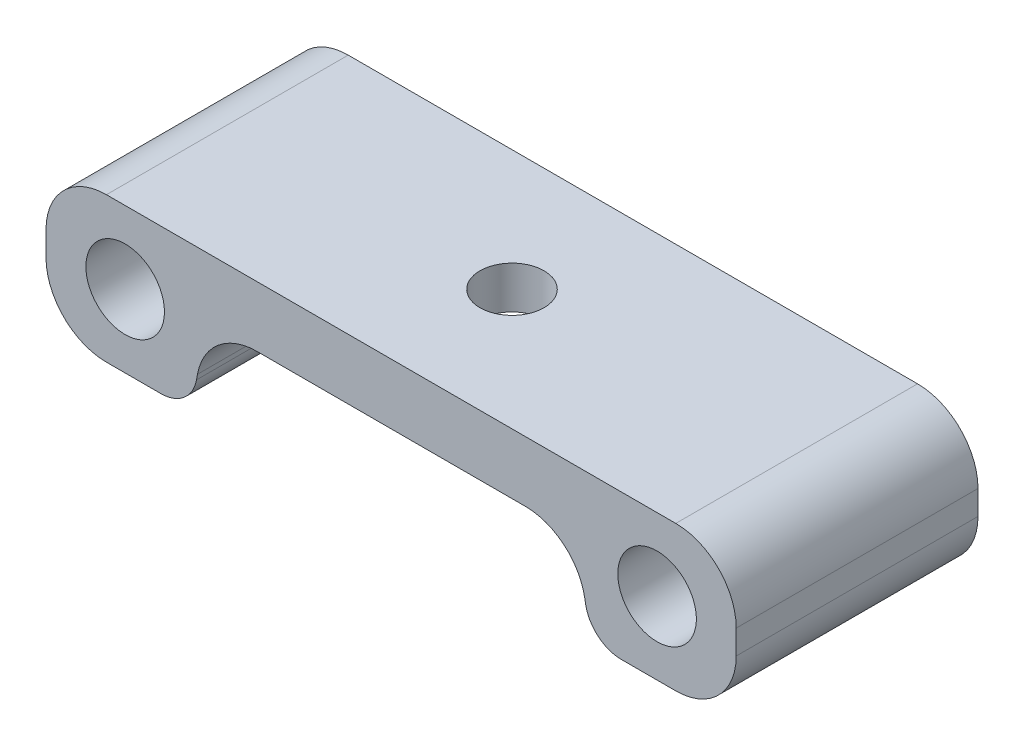
ISO-10303-21;
HEADER;
FILE_DESCRIPTION(('STEP AP214'),'2;1');
FILE_NAME('part.step','',(''),(''),'','','');
FILE_SCHEMA(('AUTOMOTIVE_DESIGN { 1 0 10303 214 1 1 1 1 }'));
ENDSEC;
DATA;
#1=APPLICATION_CONTEXT('core data for automotive mechanical design processes');
#2=APPLICATION_PROTOCOL_DEFINITION('international standard','automotive_design',2000,#1);
#3=PRODUCT_CONTEXT('',#1,'mechanical');
#4=PRODUCT('Part','Part','',(#3));
#5=PRODUCT_RELATED_PRODUCT_CATEGORY('part','',(#4));
#6=PRODUCT_DEFINITION_FORMATION('','',#4);
#7=PRODUCT_DEFINITION_CONTEXT('part definition',#1,'design');
#8=PRODUCT_DEFINITION('design','',#6,#7);
#9=PRODUCT_DEFINITION_SHAPE('','',#8);
#10=(LENGTH_UNIT() NAMED_UNIT(*) SI_UNIT(.MILLI.,.METRE.));
#11=(NAMED_UNIT(*) PLANE_ANGLE_UNIT() SI_UNIT($,.RADIAN.));
#12=(NAMED_UNIT(*) SI_UNIT($,.STERADIAN.) SOLID_ANGLE_UNIT());
#13=UNCERTAINTY_MEASURE_WITH_UNIT(LENGTH_MEASURE(1.E-05),#10,'distance_accuracy_value','');
#14=(GEOMETRIC_REPRESENTATION_CONTEXT(3) GLOBAL_UNCERTAINTY_ASSIGNED_CONTEXT((#13)) GLOBAL_UNIT_ASSIGNED_CONTEXT((#10,
#11,#12)) REPRESENTATION_CONTEXT('',''));
#15=CARTESIAN_POINT('',(0.,0.,0.));
#16=DIRECTION('',(0.,0.,1.));
#17=DIRECTION('',(1.,0.,0.));
#18=AXIS2_PLACEMENT_3D('',#15,#16,#17);
#19=CARTESIAN_POINT('',(0.,0.,10.));
#20=DIRECTION('',(0.,0.,-1.));
#21=DIRECTION('',(-1.,0.,0.));
#22=AXIS2_PLACEMENT_3D('',#19,#20,#21);
#23=PLANE('',#22);
#24=DIRECTION('',(-0.180192038345711,0.983631449942923,0.));
#25=VECTOR('',#24,1.);
#26=CARTESIAN_POINT('',(15.2657353642998,0.,10.));
#27=LINE('',#26,#25);
#28=CARTESIAN_POINT('',(16.0975262403234,-4.54057611503715,10.));
#29=VERTEX_POINT('',#28);
#30=CARTESIAN_POINT('',(16.0166409380851,-4.09903980827144,10.));
#31=VERTEX_POINT('',#30);
#32=EDGE_CURVE('E217',#29,#31,#27,.T.);
#33=ORIENTED_EDGE('',*,*,#32,.F.);
#34=CARTESIAN_POINT('',(19.0484205901522,-4.00000000000002,10.));
#35=DIRECTION('',(0.,0.,-1.));
#36=DIRECTION('',(-1.,0.,0.));
#37=AXIS2_PLACEMENT_3D('',#34,#35,#36);
#38=CIRCLE('',#37,3.);
#39=CARTESIAN_POINT('',(19.0484205901522,-7.00000000000002,10.));
#40=VERTEX_POINT('',#39);
#41=EDGE_CURVE('E316',#29,#40,#38,.F.);
#42=ORIENTED_EDGE('',*,*,#41,.T.);
#43=DIRECTION('',(-1.,0.,0.));
#44=VECTOR('',#43,1.);
#45=CARTESIAN_POINT('',(16.5480695845946,-7.00000000000001,10.));
#46=LINE('',#45,#44);
#47=CARTESIAN_POINT('',(23.5480695845946,-7.00000000000002,10.));
#48=VERTEX_POINT('',#47);
#49=EDGE_CURVE('E372',#48,#40,#46,.T.);
#50=ORIENTED_EDGE('',*,*,#49,.F.);
#51=CARTESIAN_POINT('',(23.5480695845946,-2.00000000000002,10.));
#52=DIRECTION('',(0.,0.,-1.));
#53=DIRECTION('',(-1.,0.,0.));
#54=AXIS2_PLACEMENT_3D('',#51,#52,#53);
#55=CIRCLE('',#54,5.);
#56=CARTESIAN_POINT('',(28.5480695845946,-2.00000000000003,10.));
#57=VERTEX_POINT('',#56);
#58=EDGE_CURVE('E269',#48,#57,#55,.F.);
#59=ORIENTED_EDGE('',*,*,#58,.T.);
#60=DIRECTION('',(0.,-1.,0.));
#61=VECTOR('',#60,1.);
#62=CARTESIAN_POINT('',(28.5480695845946,-7.00000000000003,10.));
#63=LINE('',#62,#61);
#64=CARTESIAN_POINT('',(28.5480695845946,0.,10.));
#65=VERTEX_POINT('',#64);
#66=EDGE_CURVE('E359',#65,#57,#63,.T.);
#67=ORIENTED_EDGE('',*,*,#66,.F.);
#68=CARTESIAN_POINT('',(23.5480695845946,0.,10.));
#69=DIRECTION('',(0.,0.,-1.));
#70=DIRECTION('',(-1.,0.,0.));
#71=AXIS2_PLACEMENT_3D('',#68,#69,#70);
#72=CIRCLE('',#71,5.);
#73=CARTESIAN_POINT('',(23.5480695845946,5.,10.));
#74=VERTEX_POINT('',#73);
#75=EDGE_CURVE('E266',#65,#74,#72,.F.);
#76=ORIENTED_EDGE('',*,*,#75,.T.);
#77=DIRECTION('',(-1.,0.,0.));
#78=VECTOR('',#77,1.);
#79=CARTESIAN_POINT('',(-28.5480695845946,5.,10.));
#80=LINE('',#79,#78);
#81=CARTESIAN_POINT('',(-23.5480695845946,5.,10.));
#82=VERTEX_POINT('',#81);
#83=EDGE_CURVE('E333',#74,#82,#80,.T.);
#84=ORIENTED_EDGE('',*,*,#83,.T.);
#85=CARTESIAN_POINT('',(-23.5480695845946,0.,10.));
#86=DIRECTION('',(0.,0.,-1.));
#87=DIRECTION('',(-1.,0.,0.));
#88=AXIS2_PLACEMENT_3D('',#85,#86,#87);
#89=CIRCLE('',#88,5.);
#90=CARTESIAN_POINT('',(-28.5480695845946,0.,10.));
#91=VERTEX_POINT('',#90);
#92=EDGE_CURVE('E260',#82,#91,#89,.F.);
#93=ORIENTED_EDGE('',*,*,#92,.T.);
#94=DIRECTION('',(0.,-1.,0.));
#95=VECTOR('',#94,1.);
#96=CARTESIAN_POINT('',(-28.5480695845946,-7.,10.));
#97=LINE('',#96,#95);
#98=CARTESIAN_POINT('',(-28.5480695845946,-2.,10.));
#99=VERTEX_POINT('',#98);
#100=EDGE_CURVE('E350',#91,#99,#97,.T.);
#101=ORIENTED_EDGE('',*,*,#100,.T.);
#102=CARTESIAN_POINT('',(-23.5480695845946,-2.,10.));
#103=DIRECTION('',(0.,0.,-1.));
#104=DIRECTION('',(-1.,0.,0.));
#105=AXIS2_PLACEMENT_3D('',#102,#103,#104);
#106=CIRCLE('',#105,5.);
#107=CARTESIAN_POINT('',(-23.5480695845946,-7.,10.));
#108=VERTEX_POINT('',#107);
#109=EDGE_CURVE('E263',#99,#108,#106,.F.);
#110=ORIENTED_EDGE('',*,*,#109,.T.);
#111=DIRECTION('',(1.,0.,0.));
#112=VECTOR('',#111,1.);
#113=CARTESIAN_POINT('',(-16.5480695845946,-7.,10.));
#114=LINE('',#113,#112);
#115=CARTESIAN_POINT('',(-19.0484205901522,-7.,10.));
#116=VERTEX_POINT('',#115);
#117=EDGE_CURVE('E348',#108,#116,#114,.T.);
#118=ORIENTED_EDGE('',*,*,#117,.T.);
#119=CARTESIAN_POINT('',(-19.0484205901522,-4.,10.));
#120=DIRECTION('',(0.,0.,-1.));
#121=DIRECTION('',(-1.,0.,0.));
#122=AXIS2_PLACEMENT_3D('',#119,#120,#121);
#123=CIRCLE('',#122,3.);
#124=CARTESIAN_POINT('',(-16.0975262403234,-4.54057611503714,10.));
#125=VERTEX_POINT('',#124);
#126=EDGE_CURVE('E62',#116,#125,#123,.F.);
#127=ORIENTED_EDGE('',*,*,#126,.T.);
#128=DIRECTION('',(0.180192038345712,0.983631449942923,0.));
#129=VECTOR('',#128,1.);
#130=CARTESIAN_POINT('',(-15.2657353642998,0.,10.));
#131=LINE('',#130,#129);
#132=CARTESIAN_POINT('',(-16.0166409380851,-4.09903980827144,10.));
#133=VERTEX_POINT('',#132);
#134=EDGE_CURVE('E230',#125,#133,#131,.T.);
#135=ORIENTED_EDGE('',*,*,#134,.T.);
#136=CARTESIAN_POINT('',(-11.0984836883705,-5.,10.));
#137=DIRECTION('',(0.,0.,-1.));
#138=DIRECTION('',(-1.,0.,0.));
#139=AXIS2_PLACEMENT_3D('',#136,#137,#138);
#140=CIRCLE('',#139,5.);
#141=CARTESIAN_POINT('',(-11.0984836883705,0.,10.));
#142=VERTEX_POINT('',#141);
#143=EDGE_CURVE('E299',#133,#142,#140,.T.);
#144=ORIENTED_EDGE('',*,*,#143,.T.);
#145=DIRECTION('',(1.,0.,0.));
#146=VECTOR('',#145,1.);
#147=CARTESIAN_POINT('',(0.,0.,10.));
#148=LINE('',#147,#146);
#149=CARTESIAN_POINT('',(11.0984836883705,0.,10.));
#150=VERTEX_POINT('',#149);
#151=EDGE_CURVE('E221',#142,#150,#148,.T.);
#152=ORIENTED_EDGE('',*,*,#151,.T.);
#153=CARTESIAN_POINT('',(11.0984836883705,-5.,10.));
#154=DIRECTION('',(0.,0.,-1.));
#155=DIRECTION('',(-1.,0.,0.));
#156=AXIS2_PLACEMENT_3D('',#153,#154,#155);
#157=CIRCLE('',#156,5.);
#158=EDGE_CURVE('E212',#150,#31,#157,.T.);
#159=ORIENTED_EDGE('',*,*,#158,.T.);
#160=EDGE_LOOP('',(#33,#42,#50,#59,#67,#76,#84,#93,#101,#110,#118,#127,#135,#144,#152,#159));
#161=FACE_BOUND('',#160,.T.);
#162=CARTESIAN_POINT('',(-22.,-0.999999999999998,10.));
#163=DIRECTION('',(0.,0.,1.));
#164=DIRECTION('',(1.,0.,0.));
#165=AXIS2_PLACEMENT_3D('',#162,#163,#164);
#166=CIRCLE('',#165,3.25);
#167=CARTESIAN_POINT('',(-18.75,-0.999999999999998,10.));
#168=VERTEX_POINT('',#167);
#169=EDGE_CURVE('E344',#168,#168,#166,.T.);
#170=ORIENTED_EDGE('',*,*,#169,.F.);
#171=EDGE_LOOP('',(#170));
#172=FACE_BOUND('',#171,.T.);
#173=CARTESIAN_POINT('',(22.,-1.00000000000002,10.));
#174=DIRECTION('',(0.,0.,-1.));
#175=DIRECTION('',(-1.,0.,0.));
#176=AXIS2_PLACEMENT_3D('',#173,#174,#175);
#177=CIRCLE('',#176,3.25);
#178=CARTESIAN_POINT('',(18.75,-1.00000000000002,10.));
#179=VERTEX_POINT('',#178);
#180=EDGE_CURVE('E202',#179,#179,#177,.T.);
#181=ORIENTED_EDGE('',*,*,#180,.T.);
#182=EDGE_LOOP('',(#181));
#183=FACE_BOUND('',#182,.T.);
#184=ADVANCED_FACE('F42',(#161,#172,#183),#23,.F.);
#185=CARTESIAN_POINT('',(0.,0.,-10.));
#186=DIRECTION('',(0.,0.,-1.));
#187=DIRECTION('',(-1.,0.,0.));
#188=AXIS2_PLACEMENT_3D('',#185,#186,#187);
#189=PLANE('',#188);
#190=DIRECTION('',(-1.,0.,0.));
#191=VECTOR('',#190,1.);
#192=CARTESIAN_POINT('',(16.5480695845946,-7.00000000000001,-10.));
#193=LINE('',#192,#191);
#194=CARTESIAN_POINT('',(23.5480695845946,-7.00000000000002,-10.));
#195=VERTEX_POINT('',#194);
#196=CARTESIAN_POINT('',(19.0484205901522,-7.00000000000002,-10.));
#197=VERTEX_POINT('',#196);
#198=EDGE_CURVE('E201',#195,#197,#193,.T.);
#199=ORIENTED_EDGE('',*,*,#198,.T.);
#200=CARTESIAN_POINT('',(19.0484205901522,-4.00000000000002,-10.));
#201=DIRECTION('',(0.,0.,-1.));
#202=DIRECTION('',(-1.,0.,0.));
#203=AXIS2_PLACEMENT_3D('',#200,#201,#202);
#204=CIRCLE('',#203,3.);
#205=CARTESIAN_POINT('',(16.0975262403234,-4.54057611503715,-10.));
#206=VERTEX_POINT('',#205);
#207=EDGE_CURVE('E196',#197,#206,#204,.T.);
#208=ORIENTED_EDGE('',*,*,#207,.T.);
#209=DIRECTION('',(-0.180192038345711,0.983631449942923,0.));
#210=VECTOR('',#209,1.);
#211=CARTESIAN_POINT('',(15.2657353642998,0.,-10.));
#212=LINE('',#211,#210);
#213=CARTESIAN_POINT('',(16.0166409380851,-4.09903980827144,-10.));
#214=VERTEX_POINT('',#213);
#215=EDGE_CURVE('E188',#206,#214,#212,.T.);
#216=ORIENTED_EDGE('',*,*,#215,.T.);
#217=CARTESIAN_POINT('',(11.0984836883705,-5.,-10.));
#218=DIRECTION('',(0.,0.,-1.));
#219=DIRECTION('',(-1.,0.,0.));
#220=AXIS2_PLACEMENT_3D('',#217,#218,#219);
#221=CIRCLE('',#220,5.);
#222=CARTESIAN_POINT('',(11.0984836883705,0.,-10.));
#223=VERTEX_POINT('',#222);
#224=EDGE_CURVE('E194',#214,#223,#221,.F.);
#225=ORIENTED_EDGE('',*,*,#224,.T.);
#226=DIRECTION('',(1.,0.,0.));
#227=VECTOR('',#226,1.);
#228=CARTESIAN_POINT('',(0.,0.,-10.));
#229=LINE('',#228,#227);
#230=CARTESIAN_POINT('',(-11.0984836883705,0.,-10.));
#231=VERTEX_POINT('',#230);
#232=EDGE_CURVE('E233',#231,#223,#229,.T.);
#233=ORIENTED_EDGE('',*,*,#232,.F.);
#234=CARTESIAN_POINT('',(-11.0984836883705,-5.,-10.));
#235=DIRECTION('',(0.,0.,-1.));
#236=DIRECTION('',(-1.,0.,0.));
#237=AXIS2_PLACEMENT_3D('',#234,#235,#236);
#238=CIRCLE('',#237,5.);
#239=CARTESIAN_POINT('',(-16.0166409380851,-4.09903980827144,-10.));
#240=VERTEX_POINT('',#239);
#241=EDGE_CURVE('E295',#231,#240,#238,.F.);
#242=ORIENTED_EDGE('',*,*,#241,.T.);
#243=DIRECTION('',(0.180192038345712,0.983631449942923,0.));
#244=VECTOR('',#243,1.);
#245=CARTESIAN_POINT('',(-15.2657353642998,0.,-10.));
#246=LINE('',#245,#244);
#247=CARTESIAN_POINT('',(-16.0975262403234,-4.54057611503714,-10.));
#248=VERTEX_POINT('',#247);
#249=EDGE_CURVE('E325',#248,#240,#246,.T.);
#250=ORIENTED_EDGE('',*,*,#249,.F.);
#251=CARTESIAN_POINT('',(-19.0484205901522,-4.,-10.));
#252=DIRECTION('',(0.,0.,-1.));
#253=DIRECTION('',(-1.,0.,0.));
#254=AXIS2_PLACEMENT_3D('',#251,#252,#253);
#255=CIRCLE('',#254,3.);
#256=CARTESIAN_POINT('',(-19.0484205901522,-7.,-10.));
#257=VERTEX_POINT('',#256);
#258=EDGE_CURVE('E306',#248,#257,#255,.T.);
#259=ORIENTED_EDGE('',*,*,#258,.T.);
#260=DIRECTION('',(1.,0.,0.));
#261=VECTOR('',#260,1.);
#262=CARTESIAN_POINT('',(-16.5480695845946,-7.,-10.));
#263=LINE('',#262,#261);
#264=CARTESIAN_POINT('',(-23.5480695845946,-7.,-10.));
#265=VERTEX_POINT('',#264);
#266=EDGE_CURVE('E330',#265,#257,#263,.T.);
#267=ORIENTED_EDGE('',*,*,#266,.F.);
#268=CARTESIAN_POINT('',(-23.5480695845946,-2.,-10.));
#269=DIRECTION('',(0.,0.,-1.));
#270=DIRECTION('',(-1.,0.,0.));
#271=AXIS2_PLACEMENT_3D('',#268,#269,#270);
#272=CIRCLE('',#271,5.);
#273=CARTESIAN_POINT('',(-28.5480695845946,-2.,-10.));
#274=VERTEX_POINT('',#273);
#275=EDGE_CURVE('E248',#265,#274,#272,.T.);
#276=ORIENTED_EDGE('',*,*,#275,.T.);
#277=DIRECTION('',(0.,-1.,0.));
#278=VECTOR('',#277,1.);
#279=CARTESIAN_POINT('',(-28.5480695845946,-7.,-10.));
#280=LINE('',#279,#278);
#281=CARTESIAN_POINT('',(-28.5480695845946,0.,-10.));
#282=VERTEX_POINT('',#281);
#283=EDGE_CURVE('E335',#282,#274,#280,.T.);
#284=ORIENTED_EDGE('',*,*,#283,.F.);
#285=CARTESIAN_POINT('',(-23.5480695845946,0.,-10.));
#286=DIRECTION('',(0.,0.,-1.));
#287=DIRECTION('',(-1.,0.,0.));
#288=AXIS2_PLACEMENT_3D('',#285,#286,#287);
#289=CIRCLE('',#288,5.);
#290=CARTESIAN_POINT('',(-23.5480695845946,5.,-10.));
#291=VERTEX_POINT('',#290);
#292=EDGE_CURVE('E245',#282,#291,#289,.T.);
#293=ORIENTED_EDGE('',*,*,#292,.T.);
#294=DIRECTION('',(-1.,0.,0.));
#295=VECTOR('',#294,1.);
#296=CARTESIAN_POINT('',(-28.5480695845946,5.,-10.));
#297=LINE('',#296,#295);
#298=CARTESIAN_POINT('',(23.5480695845946,5.,-10.));
#299=VERTEX_POINT('',#298);
#300=EDGE_CURVE('E341',#299,#291,#297,.T.);
#301=ORIENTED_EDGE('',*,*,#300,.F.);
#302=CARTESIAN_POINT('',(23.5480695845946,0.,-10.));
#303=DIRECTION('',(0.,0.,-1.));
#304=DIRECTION('',(-1.,0.,0.));
#305=AXIS2_PLACEMENT_3D('',#302,#303,#304);
#306=CIRCLE('',#305,5.);
#307=CARTESIAN_POINT('',(28.5480695845946,0.,-10.));
#308=VERTEX_POINT('',#307);
#309=EDGE_CURVE('E251',#299,#308,#306,.T.);
#310=ORIENTED_EDGE('',*,*,#309,.T.);
#311=DIRECTION('',(0.,-1.,0.));
#312=VECTOR('',#311,1.);
#313=CARTESIAN_POINT('',(28.5480695845946,-7.00000000000003,-10.));
#314=LINE('',#313,#312);
#315=CARTESIAN_POINT('',(28.5480695845946,-2.00000000000003,-10.));
#316=VERTEX_POINT('',#315);
#317=EDGE_CURVE('E363',#308,#316,#314,.T.);
#318=ORIENTED_EDGE('',*,*,#317,.T.);
#319=CARTESIAN_POINT('',(23.5480695845946,-2.00000000000002,-10.));
#320=DIRECTION('',(0.,0.,-1.));
#321=DIRECTION('',(-1.,0.,0.));
#322=AXIS2_PLACEMENT_3D('',#319,#320,#321);
#323=CIRCLE('',#322,5.);
#324=EDGE_CURVE('E254',#316,#195,#323,.T.);
#325=ORIENTED_EDGE('',*,*,#324,.T.);
#326=EDGE_LOOP('',(#199,#208,#216,#225,#233,#242,#250,#259,#267,#276,#284,#293,#301,#310,#318,#325));
#327=FACE_BOUND('',#326,.T.);
#328=CARTESIAN_POINT('',(-22.,-0.999999999999998,-10.));
#329=DIRECTION('',(0.,0.,1.));
#330=DIRECTION('',(1.,0.,0.));
#331=AXIS2_PLACEMENT_3D('',#328,#329,#330);
#332=CIRCLE('',#331,3.25);
#333=CARTESIAN_POINT('',(-18.75,-0.999999999999998,-10.));
#334=VERTEX_POINT('',#333);
#335=EDGE_CURVE('E356',#334,#334,#332,.T.);
#336=ORIENTED_EDGE('',*,*,#335,.T.);
#337=EDGE_LOOP('',(#336));
#338=FACE_BOUND('',#337,.T.);
#339=CARTESIAN_POINT('',(22.,-1.00000000000002,-10.));
#340=DIRECTION('',(0.,0.,-1.));
#341=DIRECTION('',(-1.,0.,0.));
#342=AXIS2_PLACEMENT_3D('',#339,#340,#341);
#343=CIRCLE('',#342,3.25);
#344=CARTESIAN_POINT('',(18.75,-1.00000000000002,-10.));
#345=VERTEX_POINT('',#344);
#346=EDGE_CURVE('E378',#345,#345,#343,.T.);
#347=ORIENTED_EDGE('',*,*,#346,.F.);
#348=EDGE_LOOP('',(#347));
#349=FACE_BOUND('',#348,.T.);
#350=ADVANCED_FACE('F191',(#327,#338,#349),#189,.T.);
#351=CARTESIAN_POINT('',(-28.5480695845946,5.,10.));
#352=DIRECTION('',(0.,-1.,0.));
#353=DIRECTION('',(0.,0.,-1.));
#354=AXIS2_PLACEMENT_3D('',#351,#352,#353);
#355=PLANE('',#354);
#356=CARTESIAN_POINT('',(0.,5.,0.));
#357=DIRECTION('',(0.,1.,0.));
#358=DIRECTION('',(0.,0.,1.));
#359=AXIS2_PLACEMENT_3D('',#356,#357,#358);
#360=CIRCLE('',#359,2.65);
#361=CARTESIAN_POINT('',(0.,5.,2.65));
#362=VERTEX_POINT('',#361);
#363=EDGE_CURVE('E393',#362,#362,#360,.T.);
#364=ORIENTED_EDGE('',*,*,#363,.F.);
#365=EDGE_LOOP('',(#364));
#366=FACE_BOUND('',#365,.T.);
#367=ORIENTED_EDGE('',*,*,#83,.F.);
#368=DIRECTION('',(0.,0.,-1.));
#369=VECTOR('',#368,1.);
#370=CARTESIAN_POINT('',(23.5480695845946,5.,-10.));
#371=LINE('',#370,#369);
#372=EDGE_CURVE('E275',#74,#299,#371,.T.);
#373=ORIENTED_EDGE('',*,*,#372,.T.);
#374=ORIENTED_EDGE('',*,*,#300,.T.);
#375=DIRECTION('',(0.,0.,-1.));
#376=VECTOR('',#375,1.);
#377=CARTESIAN_POINT('',(-23.5480695845946,5.,10.));
#378=LINE('',#377,#376);
#379=EDGE_CURVE('E272',#291,#82,#378,.F.);
#380=ORIENTED_EDGE('',*,*,#379,.T.);
#381=EDGE_LOOP('',(#367,#373,#374,#380));
#382=FACE_BOUND('',#381,.T.);
#383=ADVANCED_FACE('F452',(#366,#382),#355,.F.);
#384=CARTESIAN_POINT('',(-28.5480695845946,-7.,10.));
#385=DIRECTION('',(1.,0.,0.));
#386=DIRECTION('',(0.,1.,0.));
#387=AXIS2_PLACEMENT_3D('',#384,#385,#386);
#388=PLANE('',#387);
#389=ORIENTED_EDGE('',*,*,#283,.T.);
#390=DIRECTION('',(0.,0.,-1.));
#391=VECTOR('',#390,1.);
#392=CARTESIAN_POINT('',(-28.5480695845946,-2.,10.));
#393=LINE('',#392,#391);
#394=EDGE_CURVE('E213',#274,#99,#393,.F.);
#395=ORIENTED_EDGE('',*,*,#394,.T.);
#396=ORIENTED_EDGE('',*,*,#100,.F.);
#397=DIRECTION('',(0.,0.,-1.));
#398=VECTOR('',#397,1.);
#399=CARTESIAN_POINT('',(-28.5480695845946,0.,10.));
#400=LINE('',#399,#398);
#401=EDGE_CURVE('E287',#91,#282,#400,.T.);
#402=ORIENTED_EDGE('',*,*,#401,.T.);
#403=EDGE_LOOP('',(#389,#395,#396,#402));
#404=FACE_BOUND('',#403,.T.);
#405=ADVANCED_FACE('F461',(#404),#388,.F.);
#406=CARTESIAN_POINT('',(-16.5480695845946,-7.,10.));
#407=DIRECTION('',(0.,1.,0.));
#408=DIRECTION('',(-1.,0.,0.));
#409=AXIS2_PLACEMENT_3D('',#406,#407,#408);
#410=PLANE('',#409);
#411=ORIENTED_EDGE('',*,*,#266,.T.);
#412=DIRECTION('',(0.,0.,-1.));
#413=VECTOR('',#412,1.);
#414=CARTESIAN_POINT('',(-19.0484205901522,-7.,10.));
#415=LINE('',#414,#413);
#416=EDGE_CURVE('E11',#257,#116,#415,.F.);
#417=ORIENTED_EDGE('',*,*,#416,.T.);
#418=ORIENTED_EDGE('',*,*,#117,.F.);
#419=DIRECTION('',(0.,0.,-1.));
#420=VECTOR('',#419,1.);
#421=CARTESIAN_POINT('',(-23.5480695845946,-7.,10.));
#422=LINE('',#421,#420);
#423=EDGE_CURVE('E283',#108,#265,#422,.T.);
#424=ORIENTED_EDGE('',*,*,#423,.T.);
#425=EDGE_LOOP('',(#411,#417,#418,#424));
#426=FACE_BOUND('',#425,.T.);
#427=ADVANCED_FACE('F467',(#426),#410,.F.);
#428=CARTESIAN_POINT('',(-15.2657353642998,0.,10.));
#429=DIRECTION('',(-0.983631449942923,0.180192038345712,0.));
#430=DIRECTION('',(-0.180192038345712,-0.983631449942923,0.));
#431=AXIS2_PLACEMENT_3D('',#428,#429,#430);
#432=PLANE('',#431);
#433=ORIENTED_EDGE('',*,*,#134,.F.);
#434=DIRECTION('',(0.,0.,-1.));
#435=VECTOR('',#434,1.);
#436=CARTESIAN_POINT('',(-16.0975262403234,-4.54057611503713,10.));
#437=LINE('',#436,#435);
#438=EDGE_CURVE('E52',#125,#248,#437,.T.);
#439=ORIENTED_EDGE('',*,*,#438,.T.);
#440=ORIENTED_EDGE('',*,*,#249,.T.);
#441=DIRECTION('',(0.,0.,-1.));
#442=VECTOR('',#441,1.);
#443=CARTESIAN_POINT('',(-16.0166409380851,-4.09903980827144,10.));
#444=LINE('',#443,#442);
#445=EDGE_CURVE('E279',#240,#133,#444,.F.);
#446=ORIENTED_EDGE('',*,*,#445,.T.);
#447=EDGE_LOOP('',(#433,#439,#440,#446));
#448=FACE_BOUND('',#447,.T.);
#449=ADVANCED_FACE('F324',(#448),#432,.F.);
#450=CARTESIAN_POINT('',(0.,0.,10.));
#451=DIRECTION('',(0.,1.,0.));
#452=DIRECTION('',(-1.,0.,0.));
#453=AXIS2_PLACEMENT_3D('',#450,#451,#452);
#454=PLANE('',#453);
#455=CARTESIAN_POINT('',(0.,0.,0.));
#456=DIRECTION('',(0.,-1.,0.));
#457=DIRECTION('',(1.,0.,0.));
#458=AXIS2_PLACEMENT_3D('',#455,#456,#457);
#459=CIRCLE('',#458,6.);
#460=CARTESIAN_POINT('',(6.,0.,0.));
#461=VERTEX_POINT('',#460);
#462=EDGE_CURVE('E386',#461,#461,#459,.T.);
#463=ORIENTED_EDGE('',*,*,#462,.F.);
#464=EDGE_LOOP('',(#463));
#465=FACE_BOUND('',#464,.T.);
#466=ORIENTED_EDGE('',*,*,#232,.T.);
#467=DIRECTION('',(0.,0.,-1.));
#468=VECTOR('',#467,1.);
#469=CARTESIAN_POINT('',(11.0984836883705,0.,10.));
#470=LINE('',#469,#468);
#471=EDGE_CURVE('E210',#223,#150,#470,.F.);
#472=ORIENTED_EDGE('',*,*,#471,.T.);
#473=ORIENTED_EDGE('',*,*,#151,.F.);
#474=DIRECTION('',(0.,0.,-1.));
#475=VECTOR('',#474,1.);
#476=CARTESIAN_POINT('',(-11.0984836883705,0.,-10.));
#477=LINE('',#476,#475);
#478=EDGE_CURVE('E220',#142,#231,#477,.T.);
#479=ORIENTED_EDGE('',*,*,#478,.T.);
#480=EDGE_LOOP('',(#466,#472,#473,#479));
#481=FACE_BOUND('',#480,.T.);
#482=ADVANCED_FACE('F416',(#465,#481),#454,.F.);
#483=CARTESIAN_POINT('',(-22.,-0.999999999999998,10.));
#484=DIRECTION('',(0.,0.,-1.));
#485=DIRECTION('',(-1.,0.,0.));
#486=AXIS2_PLACEMENT_3D('',#483,#484,#485);
#487=CYLINDRICAL_SURFACE('',#486,3.25);
#488=ORIENTED_EDGE('',*,*,#169,.T.);
#489=EDGE_LOOP('',(#488));
#490=FACE_BOUND('',#489,.T.);
#491=ORIENTED_EDGE('',*,*,#335,.F.);
#492=EDGE_LOOP('',(#491));
#493=FACE_BOUND('',#492,.T.);
#494=ADVANCED_FACE('F419',(#490,#493),#487,.F.);
#495=CARTESIAN_POINT('',(15.2657353642998,0.,10.));
#496=DIRECTION('',(-0.983631449942923,-0.180192038345711,0.));
#497=DIRECTION('',(0.180192038345711,-0.983631449942924,0.));
#498=AXIS2_PLACEMENT_3D('',#495,#496,#497);
#499=PLANE('',#498);
#500=ORIENTED_EDGE('',*,*,#215,.F.);
#501=DIRECTION('',(0.,0.,-1.));
#502=VECTOR('',#501,1.);
#503=CARTESIAN_POINT('',(16.0975262403234,-4.54057611503715,10.));
#504=LINE('',#503,#502);
#505=EDGE_CURVE('E311',#206,#29,#504,.F.);
#506=ORIENTED_EDGE('',*,*,#505,.T.);
#507=ORIENTED_EDGE('',*,*,#32,.T.);
#508=DIRECTION('',(0.,0.,-1.));
#509=VECTOR('',#508,1.);
#510=CARTESIAN_POINT('',(16.0166409380851,-4.09903980827144,10.));
#511=LINE('',#510,#509);
#512=EDGE_CURVE('E209',#31,#214,#511,.T.);
#513=ORIENTED_EDGE('',*,*,#512,.T.);
#514=EDGE_LOOP('',(#500,#506,#507,#513));
#515=FACE_BOUND('',#514,.T.);
#516=ADVANCED_FACE('F215',(#515),#499,.T.);
#517=CARTESIAN_POINT('',(16.5480695845946,-7.00000000000001,10.));
#518=DIRECTION('',(0.,-1.,0.));
#519=DIRECTION('',(1.,0.,0.));
#520=AXIS2_PLACEMENT_3D('',#517,#518,#519);
#521=PLANE('',#520);
#522=ORIENTED_EDGE('',*,*,#49,.T.);
#523=DIRECTION('',(0.,0.,-1.));
#524=VECTOR('',#523,1.);
#525=CARTESIAN_POINT('',(19.0484205901522,-7.00000000000002,10.));
#526=LINE('',#525,#524);
#527=EDGE_CURVE('E302',#40,#197,#526,.T.);
#528=ORIENTED_EDGE('',*,*,#527,.T.);
#529=ORIENTED_EDGE('',*,*,#198,.F.);
#530=DIRECTION('',(0.,0.,-1.));
#531=VECTOR('',#530,1.);
#532=CARTESIAN_POINT('',(23.5480695845946,-7.00000000000002,10.));
#533=LINE('',#532,#531);
#534=EDGE_CURVE('E257',#195,#48,#533,.F.);
#535=ORIENTED_EDGE('',*,*,#534,.T.);
#536=EDGE_LOOP('',(#522,#528,#529,#535));
#537=FACE_BOUND('',#536,.T.);
#538=ADVANCED_FACE('F434',(#537),#521,.T.);
#539=CARTESIAN_POINT('',(28.5480695845946,-7.00000000000003,10.));
#540=DIRECTION('',(1.,0.,0.));
#541=DIRECTION('',(0.,1.,0.));
#542=AXIS2_PLACEMENT_3D('',#539,#540,#541);
#543=PLANE('',#542);
#544=ORIENTED_EDGE('',*,*,#66,.T.);
#545=DIRECTION('',(0.,0.,-1.));
#546=VECTOR('',#545,1.);
#547=CARTESIAN_POINT('',(28.5480695845946,-2.00000000000003,10.));
#548=LINE('',#547,#546);
#549=EDGE_CURVE('E241',#57,#316,#548,.T.);
#550=ORIENTED_EDGE('',*,*,#549,.T.);
#551=ORIENTED_EDGE('',*,*,#317,.F.);
#552=DIRECTION('',(0.,0.,-1.));
#553=VECTOR('',#552,1.);
#554=CARTESIAN_POINT('',(28.5480695845946,0.,10.));
#555=LINE('',#554,#553);
#556=EDGE_CURVE('E238',#308,#65,#555,.F.);
#557=ORIENTED_EDGE('',*,*,#556,.T.);
#558=EDGE_LOOP('',(#544,#550,#551,#557));
#559=FACE_BOUND('',#558,.T.);
#560=ADVANCED_FACE('F442',(#559),#543,.T.);
#561=CARTESIAN_POINT('',(22.,-1.00000000000002,10.));
#562=DIRECTION('',(0.,0.,-1.));
#563=DIRECTION('',(-1.,0.,0.));
#564=AXIS2_PLACEMENT_3D('',#561,#562,#563);
#565=CYLINDRICAL_SURFACE('',#564,3.25);
#566=ORIENTED_EDGE('',*,*,#180,.F.);
#567=EDGE_LOOP('',(#566));
#568=FACE_BOUND('',#567,.T.);
#569=ORIENTED_EDGE('',*,*,#346,.T.);
#570=EDGE_LOOP('',(#569));
#571=FACE_BOUND('',#570,.T.);
#572=ADVANCED_FACE('F492',(#568,#571),#565,.F.);
#573=CARTESIAN_POINT('',(11.0984836883705,-5.,10.));
#574=DIRECTION('',(0.,0.,-1.));
#575=DIRECTION('',(-1.,0.,0.));
#576=AXIS2_PLACEMENT_3D('',#573,#574,#575);
#577=CYLINDRICAL_SURFACE('',#576,5.);
#578=ORIENTED_EDGE('',*,*,#158,.F.);
#579=ORIENTED_EDGE('',*,*,#471,.F.);
#580=ORIENTED_EDGE('',*,*,#224,.F.);
#581=ORIENTED_EDGE('',*,*,#512,.F.);
#582=EDGE_LOOP('',(#578,#579,#580,#581));
#583=FACE_BOUND('',#582,.T.);
#584=ADVANCED_FACE('F208',(#583),#577,.F.);
#585=CARTESIAN_POINT('',(23.5480695845946,-2.00000000000002,10.));
#586=DIRECTION('',(0.,0.,-1.));
#587=DIRECTION('',(-1.,0.,0.));
#588=AXIS2_PLACEMENT_3D('',#585,#586,#587);
#589=CYLINDRICAL_SURFACE('',#588,5.);
#590=ORIENTED_EDGE('',*,*,#58,.F.);
#591=ORIENTED_EDGE('',*,*,#534,.F.);
#592=ORIENTED_EDGE('',*,*,#324,.F.);
#593=ORIENTED_EDGE('',*,*,#549,.F.);
#594=EDGE_LOOP('',(#590,#591,#592,#593));
#595=FACE_BOUND('',#594,.T.);
#596=ADVANCED_FACE('F440',(#595),#589,.T.);
#597=CARTESIAN_POINT('',(23.5480695845946,0.,10.));
#598=DIRECTION('',(0.,0.,1.));
#599=DIRECTION('',(1.,0.,0.));
#600=AXIS2_PLACEMENT_3D('',#597,#598,#599);
#601=CYLINDRICAL_SURFACE('',#600,5.);
#602=ORIENTED_EDGE('',*,*,#75,.F.);
#603=ORIENTED_EDGE('',*,*,#556,.F.);
#604=ORIENTED_EDGE('',*,*,#309,.F.);
#605=ORIENTED_EDGE('',*,*,#372,.F.);
#606=EDGE_LOOP('',(#602,#603,#604,#605));
#607=FACE_BOUND('',#606,.T.);
#608=ADVANCED_FACE('F449',(#607),#601,.T.);
#609=CARTESIAN_POINT('',(-11.0984836883705,-5.,10.));
#610=DIRECTION('',(0.,0.,1.));
#611=DIRECTION('',(1.,0.,0.));
#612=AXIS2_PLACEMENT_3D('',#609,#610,#611);
#613=CYLINDRICAL_SURFACE('',#612,5.);
#614=ORIENTED_EDGE('',*,*,#143,.F.);
#615=ORIENTED_EDGE('',*,*,#445,.F.);
#616=ORIENTED_EDGE('',*,*,#241,.F.);
#617=ORIENTED_EDGE('',*,*,#478,.F.);
#618=EDGE_LOOP('',(#614,#615,#616,#617));
#619=FACE_BOUND('',#618,.T.);
#620=ADVANCED_FACE('F425',(#619),#613,.F.);
#621=CARTESIAN_POINT('',(-23.5480695845946,-2.,10.));
#622=DIRECTION('',(0.,0.,-1.));
#623=DIRECTION('',(-1.,0.,0.));
#624=AXIS2_PLACEMENT_3D('',#621,#622,#623);
#625=CYLINDRICAL_SURFACE('',#624,5.);
#626=ORIENTED_EDGE('',*,*,#109,.F.);
#627=ORIENTED_EDGE('',*,*,#394,.F.);
#628=ORIENTED_EDGE('',*,*,#275,.F.);
#629=ORIENTED_EDGE('',*,*,#423,.F.);
#630=EDGE_LOOP('',(#626,#627,#628,#629));
#631=FACE_BOUND('',#630,.T.);
#632=ADVANCED_FACE('F466',(#631),#625,.T.);
#633=CARTESIAN_POINT('',(-23.5480695845946,0.,10.));
#634=DIRECTION('',(0.,0.,-1.));
#635=DIRECTION('',(-1.,0.,0.));
#636=AXIS2_PLACEMENT_3D('',#633,#634,#635);
#637=CYLINDRICAL_SURFACE('',#636,5.);
#638=ORIENTED_EDGE('',*,*,#92,.F.);
#639=ORIENTED_EDGE('',*,*,#379,.F.);
#640=ORIENTED_EDGE('',*,*,#292,.F.);
#641=ORIENTED_EDGE('',*,*,#401,.F.);
#642=EDGE_LOOP('',(#638,#639,#640,#641));
#643=FACE_BOUND('',#642,.T.);
#644=ADVANCED_FACE('F458',(#643),#637,.T.);
#645=CARTESIAN_POINT('',(19.0484205901522,-4.00000000000002,10.));
#646=DIRECTION('',(0.,0.,-1.));
#647=DIRECTION('',(-1.,0.,0.));
#648=AXIS2_PLACEMENT_3D('',#645,#646,#647);
#649=CYLINDRICAL_SURFACE('',#648,3.);
#650=ORIENTED_EDGE('',*,*,#41,.F.);
#651=ORIENTED_EDGE('',*,*,#505,.F.);
#652=ORIENTED_EDGE('',*,*,#207,.F.);
#653=ORIENTED_EDGE('',*,*,#527,.F.);
#654=EDGE_LOOP('',(#650,#651,#652,#653));
#655=FACE_BOUND('',#654,.T.);
#656=ADVANCED_FACE('F431',(#655),#649,.T.);
#657=CARTESIAN_POINT('',(-19.0484205901522,-4.,10.));
#658=DIRECTION('',(0.,0.,-1.));
#659=DIRECTION('',(-1.,0.,0.));
#660=AXIS2_PLACEMENT_3D('',#657,#658,#659);
#661=CYLINDRICAL_SURFACE('',#660,3.);
#662=ORIENTED_EDGE('',*,*,#126,.F.);
#663=ORIENTED_EDGE('',*,*,#416,.F.);
#664=ORIENTED_EDGE('',*,*,#258,.F.);
#665=ORIENTED_EDGE('',*,*,#438,.F.);
#666=EDGE_LOOP('',(#662,#663,#664,#665));
#667=FACE_BOUND('',#666,.T.);
#668=ADVANCED_FACE('F44',(#667),#661,.T.);
#669=CARTESIAN_POINT('',(0.,1.5,0.));
#670=DIRECTION('',(0.,-1.,0.));
#671=DIRECTION('',(1.,0.,0.));
#672=AXIS2_PLACEMENT_3D('',#669,#670,#671);
#673=CYLINDRICAL_SURFACE('',#672,6.);
#674=CARTESIAN_POINT('',(0.,1.5,0.));
#675=DIRECTION('',(0.,-1.,0.));
#676=DIRECTION('',(1.,0.,0.));
#677=AXIS2_PLACEMENT_3D('',#674,#675,#676);
#678=CIRCLE('',#677,6.);
#679=CARTESIAN_POINT('',(6.,1.5,0.));
#680=VERTEX_POINT('',#679);
#681=EDGE_CURVE('E382',#680,#680,#678,.T.);
#682=ORIENTED_EDGE('',*,*,#681,.F.);
#683=EDGE_LOOP('',(#682));
#684=FACE_BOUND('',#683,.T.);
#685=ORIENTED_EDGE('',*,*,#462,.T.);
#686=EDGE_LOOP('',(#685));
#687=FACE_BOUND('',#686,.T.);
#688=ADVANCED_FACE('F407',(#684,#687),#673,.F.);
#689=CARTESIAN_POINT('',(0.,1.5,0.));
#690=DIRECTION('',(0.,-1.,0.));
#691=DIRECTION('',(1.,0.,0.));
#692=AXIS2_PLACEMENT_3D('',#689,#690,#691);
#693=PLANE('',#692);
#694=CARTESIAN_POINT('',(0.,1.5,0.));
#695=DIRECTION('',(0.,-1.,0.));
#696=DIRECTION('',(1.,0.,0.));
#697=AXIS2_PLACEMENT_3D('',#694,#695,#696);
#698=CIRCLE('',#697,2.65);
#699=CARTESIAN_POINT('',(2.65,1.5,0.));
#700=VERTEX_POINT('',#699);
#701=EDGE_CURVE('E46',#700,#700,#698,.T.);
#702=ORIENTED_EDGE('',*,*,#701,.F.);
#703=EDGE_LOOP('',(#702));
#704=FACE_BOUND('',#703,.T.);
#705=ORIENTED_EDGE('',*,*,#681,.T.);
#706=EDGE_LOOP('',(#705));
#707=FACE_BOUND('',#706,.T.);
#708=ADVANCED_FACE('F404',(#704,#707),#693,.T.);
#709=CARTESIAN_POINT('',(0.,-7.00000000000002,0.));
#710=DIRECTION('',(0.,1.,0.));
#711=DIRECTION('',(0.,0.,1.));
#712=AXIS2_PLACEMENT_3D('',#709,#710,#711);
#713=CYLINDRICAL_SURFACE('',#712,2.65);
#714=ORIENTED_EDGE('',*,*,#701,.T.);
#715=EDGE_LOOP('',(#714));
#716=FACE_BOUND('',#715,.T.);
#717=ORIENTED_EDGE('',*,*,#363,.T.);
#718=EDGE_LOOP('',(#717));
#719=FACE_BOUND('',#718,.T.);
#720=ADVANCED_FACE('F402',(#716,#719),#713,.F.);
#721=CLOSED_SHELL('',(#184,#350,#383,#405,#427,#449,#482,#494,#516,#538,#560,#572,#584,#596,
#608,#620,#632,#644,#656,#668,#688,#708,#720));
#722=MANIFOLD_SOLID_BREP('B2',#721);
#723=ADVANCED_BREP_SHAPE_REPRESENTATION('',(#18,#722),#14);
#724=SHAPE_DEFINITION_REPRESENTATION(#9,#723);
ENDSEC;
END-ISO-10303-21;
